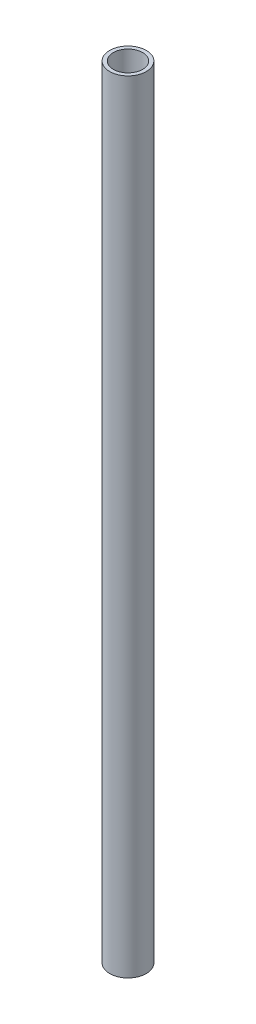
ISO-10303-21;
HEADER;
FILE_DESCRIPTION(('STEP AP214'),'2;1');
FILE_NAME('part.step','',(''),(''),'','','');
FILE_SCHEMA(('AUTOMOTIVE_DESIGN { 1 0 10303 214 1 1 1 1 }'));
ENDSEC;
DATA;
#1=APPLICATION_CONTEXT('core data for automotive mechanical design processes');
#2=APPLICATION_PROTOCOL_DEFINITION('international standard','automotive_design',2000,#1);
#3=PRODUCT_CONTEXT('',#1,'mechanical');
#4=PRODUCT('Part','Part','',(#3));
#5=PRODUCT_RELATED_PRODUCT_CATEGORY('part','',(#4));
#6=PRODUCT_DEFINITION_FORMATION('','',#4);
#7=PRODUCT_DEFINITION_CONTEXT('part definition',#1,'design');
#8=PRODUCT_DEFINITION('design','',#6,#7);
#9=PRODUCT_DEFINITION_SHAPE('','',#8);
#10=(LENGTH_UNIT() NAMED_UNIT(*) SI_UNIT(.MILLI.,.METRE.));
#11=(NAMED_UNIT(*) PLANE_ANGLE_UNIT() SI_UNIT($,.RADIAN.));
#12=(NAMED_UNIT(*) SI_UNIT($,.STERADIAN.) SOLID_ANGLE_UNIT());
#13=UNCERTAINTY_MEASURE_WITH_UNIT(LENGTH_MEASURE(1.E-05),#10,'distance_accuracy_value','');
#14=(GEOMETRIC_REPRESENTATION_CONTEXT(3) GLOBAL_UNCERTAINTY_ASSIGNED_CONTEXT((#13)) GLOBAL_UNIT_ASSIGNED_CONTEXT((#10,
#11,#12)) REPRESENTATION_CONTEXT('',''));
#15=CARTESIAN_POINT('',(0.,0.,0.));
#16=DIRECTION('',(0.,0.,1.));
#17=DIRECTION('',(1.,0.,0.));
#18=AXIS2_PLACEMENT_3D('',#15,#16,#17);
#19=CARTESIAN_POINT('',(0.,203.2,0.));
#20=DIRECTION('',(0.,1.,0.));
#21=DIRECTION('',(0.,0.,1.));
#22=AXIS2_PLACEMENT_3D('',#19,#20,#21);
#23=PLANE('',#22);
#24=CARTESIAN_POINT('',(0.,203.2,0.));
#25=DIRECTION('',(0.,1.,0.));
#26=DIRECTION('',(0.,0.,1.));
#27=AXIS2_PLACEMENT_3D('',#24,#25,#26);
#28=CIRCLE('',#27,4.7625);
#29=CARTESIAN_POINT('',(0.,203.2,4.7625));
#30=VERTEX_POINT('',#29);
#31=EDGE_CURVE('E10',#30,#30,#28,.T.);
#32=ORIENTED_EDGE('',*,*,#31,.T.);
#33=EDGE_LOOP('',(#32));
#34=FACE_BOUND('',#33,.T.);
#35=CARTESIAN_POINT('',(0.,203.2,0.));
#36=DIRECTION('',(0.,1.,0.));
#37=DIRECTION('',(0.,0.,1.));
#38=AXIS2_PLACEMENT_3D('',#35,#36,#37);
#39=CIRCLE('',#38,3.81);
#40=CARTESIAN_POINT('',(0.,203.2,3.81));
#41=VERTEX_POINT('',#40);
#42=EDGE_CURVE('E42',#41,#41,#39,.T.);
#43=ORIENTED_EDGE('',*,*,#42,.F.);
#44=EDGE_LOOP('',(#43));
#45=FACE_BOUND('',#44,.T.);
#46=ADVANCED_FACE('F31',(#34,#45),#23,.T.);
#47=CARTESIAN_POINT('',(0.,0.,0.));
#48=DIRECTION('',(0.,1.,0.));
#49=DIRECTION('',(0.,0.,1.));
#50=AXIS2_PLACEMENT_3D('',#47,#48,#49);
#51=PLANE('',#50);
#52=CARTESIAN_POINT('',(0.,0.,0.));
#53=DIRECTION('',(0.,1.,0.));
#54=DIRECTION('',(0.,0.,1.));
#55=AXIS2_PLACEMENT_3D('',#52,#53,#54);
#56=CIRCLE('',#55,4.7625);
#57=CARTESIAN_POINT('',(0.,0.,4.7625));
#58=VERTEX_POINT('',#57);
#59=EDGE_CURVE('E35',#58,#58,#56,.T.);
#60=ORIENTED_EDGE('',*,*,#59,.F.);
#61=EDGE_LOOP('',(#60));
#62=FACE_BOUND('',#61,.T.);
#63=CARTESIAN_POINT('',(0.,0.,0.));
#64=DIRECTION('',(0.,1.,0.));
#65=DIRECTION('',(0.,0.,1.));
#66=AXIS2_PLACEMENT_3D('',#63,#64,#65);
#67=CIRCLE('',#66,3.81);
#68=CARTESIAN_POINT('',(0.,0.,3.81));
#69=VERTEX_POINT('',#68);
#70=EDGE_CURVE('E44',#69,#69,#67,.T.);
#71=ORIENTED_EDGE('',*,*,#70,.T.);
#72=EDGE_LOOP('',(#71));
#73=FACE_BOUND('',#72,.T.);
#74=ADVANCED_FACE('F54',(#62,#73),#51,.F.);
#75=CARTESIAN_POINT('',(0.,203.2,0.));
#76=DIRECTION('',(0.,-1.,0.));
#77=DIRECTION('',(0.,0.,-1.));
#78=AXIS2_PLACEMENT_3D('',#75,#76,#77);
#79=CYLINDRICAL_SURFACE('',#78,4.7625);
#80=ORIENTED_EDGE('',*,*,#31,.F.);
#81=EDGE_LOOP('',(#80));
#82=FACE_BOUND('',#81,.T.);
#83=ORIENTED_EDGE('',*,*,#59,.T.);
#84=EDGE_LOOP('',(#83));
#85=FACE_BOUND('',#84,.T.);
#86=ADVANCED_FACE('F33',(#82,#85),#79,.T.);
#87=CARTESIAN_POINT('',(0.,203.2,0.));
#88=DIRECTION('',(0.,-1.,0.));
#89=DIRECTION('',(0.,0.,-1.));
#90=AXIS2_PLACEMENT_3D('',#87,#88,#89);
#91=CYLINDRICAL_SURFACE('',#90,3.81);
#92=ORIENTED_EDGE('',*,*,#42,.T.);
#93=EDGE_LOOP('',(#92));
#94=FACE_BOUND('',#93,.T.);
#95=ORIENTED_EDGE('',*,*,#70,.F.);
#96=EDGE_LOOP('',(#95));
#97=FACE_BOUND('',#96,.T.);
#98=ADVANCED_FACE('F50',(#94,#97),#91,.F.);
#99=CLOSED_SHELL('',(#46,#74,#86,#98));
#100=MANIFOLD_SOLID_BREP('B2',#99);
#101=ADVANCED_BREP_SHAPE_REPRESENTATION('',(#18,#100),#14);
#102=SHAPE_DEFINITION_REPRESENTATION(#9,#101);
ENDSEC;
END-ISO-10303-21;
